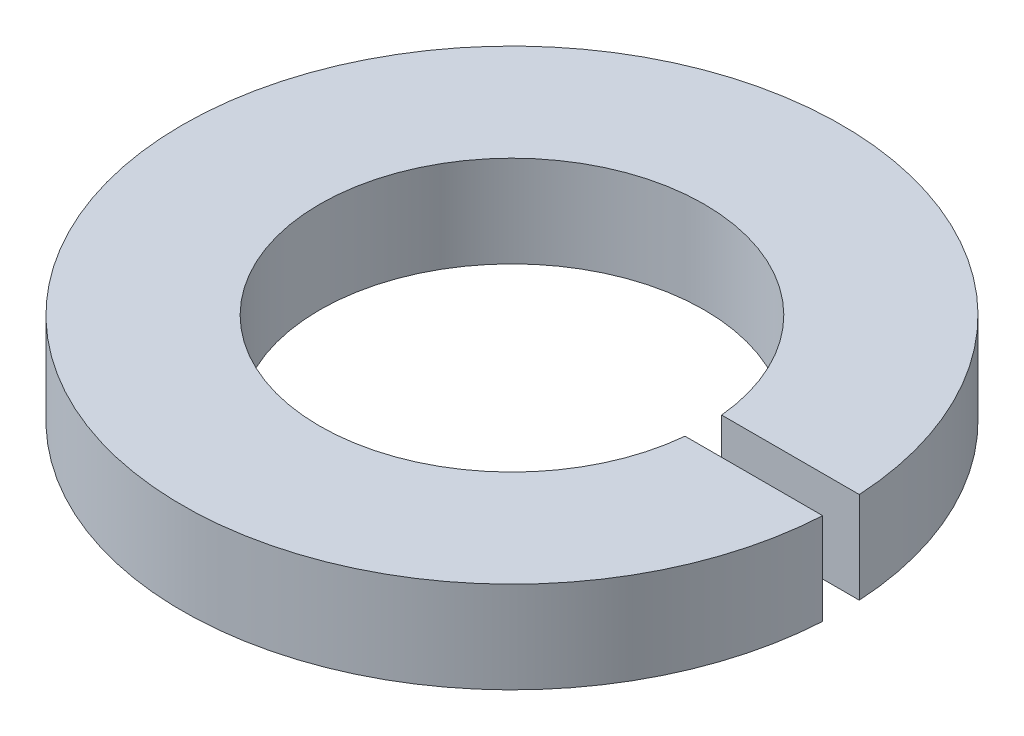
ISO-10303-21;
HEADER;
FILE_DESCRIPTION(('STEP AP214'),'2;1');
FILE_NAME('part.step','',(''),(''),'','','');
FILE_SCHEMA(('AUTOMOTIVE_DESIGN { 1 0 10303 214 1 1 1 1 }'));
ENDSEC;
DATA;
#1=APPLICATION_CONTEXT('core data for automotive mechanical design processes');
#2=APPLICATION_PROTOCOL_DEFINITION('international standard','automotive_design',2000,#1);
#3=PRODUCT_CONTEXT('',#1,'mechanical');
#4=PRODUCT('Part','Part','',(#3));
#5=PRODUCT_RELATED_PRODUCT_CATEGORY('part','',(#4));
#6=PRODUCT_DEFINITION_FORMATION('','',#4);
#7=PRODUCT_DEFINITION_CONTEXT('part definition',#1,'design');
#8=PRODUCT_DEFINITION('design','',#6,#7);
#9=PRODUCT_DEFINITION_SHAPE('','',#8);
#10=(LENGTH_UNIT() NAMED_UNIT(*) SI_UNIT(.MILLI.,.METRE.));
#11=(NAMED_UNIT(*) PLANE_ANGLE_UNIT() SI_UNIT($,.RADIAN.));
#12=(NAMED_UNIT(*) SI_UNIT($,.STERADIAN.) SOLID_ANGLE_UNIT());
#13=UNCERTAINTY_MEASURE_WITH_UNIT(LENGTH_MEASURE(1.E-05),#10,'distance_accuracy_value','');
#14=(GEOMETRIC_REPRESENTATION_CONTEXT(3) GLOBAL_UNCERTAINTY_ASSIGNED_CONTEXT((#13)) GLOBAL_UNIT_ASSIGNED_CONTEXT((#10,
#11,#12)) REPRESENTATION_CONTEXT('',''));
#15=CARTESIAN_POINT('',(0.,0.,0.));
#16=DIRECTION('',(0.,0.,1.));
#17=DIRECTION('',(1.,0.,0.));
#18=AXIS2_PLACEMENT_3D('',#15,#16,#17);
#19=CARTESIAN_POINT('',(0.,1.,0.));
#20=DIRECTION('',(0.,1.,0.));
#21=DIRECTION('',(0.,0.,1.));
#22=AXIS2_PLACEMENT_3D('',#19,#20,#21);
#23=PLANE('',#22);
#24=DIRECTION('',(1.,0.,0.));
#25=VECTOR('',#24,1.);
#26=CARTESIAN_POINT('',(2.,1.,0.2));
#27=LINE('',#26,#25);
#28=CARTESIAN_POINT('',(3.59444015112229,1.,0.2));
#29=VERTEX_POINT('',#28);
#30=CARTESIAN_POINT('',(2.09045449603669,1.,0.2));
#31=VERTEX_POINT('',#30);
#32=EDGE_CURVE('E60',#29,#31,#27,.F.);
#33=ORIENTED_EDGE('',*,*,#32,.T.);
#34=CARTESIAN_POINT('',(0.,1.,0.));
#35=DIRECTION('',(0.,-1.,0.));
#36=DIRECTION('',(0.,0.,-1.));
#37=AXIS2_PLACEMENT_3D('',#34,#35,#36);
#38=CIRCLE('',#37,2.1);
#39=CARTESIAN_POINT('',(2.09045449603669,1.,-0.2));
#40=VERTEX_POINT('',#39);
#41=EDGE_CURVE('E20',#31,#40,#38,.T.);
#42=ORIENTED_EDGE('',*,*,#41,.T.);
#43=DIRECTION('',(-1.,0.,0.));
#44=VECTOR('',#43,1.);
#45=CARTESIAN_POINT('',(2.,1.,-0.2));
#46=LINE('',#45,#44);
#47=CARTESIAN_POINT('',(3.59444015112229,1.,-0.2));
#48=VERTEX_POINT('',#47);
#49=EDGE_CURVE('E63',#40,#48,#46,.F.);
#50=ORIENTED_EDGE('',*,*,#49,.T.);
#51=CARTESIAN_POINT('',(0.,1.,0.));
#52=DIRECTION('',(0.,-1.,0.));
#53=DIRECTION('',(0.,0.,-1.));
#54=AXIS2_PLACEMENT_3D('',#51,#52,#53);
#55=CIRCLE('',#54,3.6);
#56=EDGE_CURVE('E58',#29,#48,#55,.T.);
#57=ORIENTED_EDGE('',*,*,#56,.F.);
#58=EDGE_LOOP('',(#33,#42,#50,#57));
#59=FACE_BOUND('',#58,.T.);
#60=ADVANCED_FACE('F17',(#59),#23,.T.);
#61=CARTESIAN_POINT('',(2.,0.,0.2));
#62=DIRECTION('',(0.,0.,1.));
#63=DIRECTION('',(1.,0.,0.));
#64=AXIS2_PLACEMENT_3D('',#61,#62,#63);
#65=PLANE('',#64);
#66=DIRECTION('',(0.,-1.,0.));
#67=VECTOR('',#66,1.);
#68=CARTESIAN_POINT('',(2.09045449603669,1.,0.2));
#69=LINE('',#68,#67);
#70=CARTESIAN_POINT('',(2.09045449603669,0.,0.2));
#71=VERTEX_POINT('',#70);
#72=EDGE_CURVE('E73',#71,#31,#69,.F.);
#73=ORIENTED_EDGE('',*,*,#72,.T.);
#74=ORIENTED_EDGE('',*,*,#32,.F.);
#75=DIRECTION('',(0.,1.,0.));
#76=VECTOR('',#75,1.);
#77=CARTESIAN_POINT('',(3.59444015112229,0.,0.2));
#78=LINE('',#77,#76);
#79=CARTESIAN_POINT('',(3.59444015112229,0.,0.2));
#80=VERTEX_POINT('',#79);
#81=EDGE_CURVE('E72',#80,#29,#78,.T.);
#82=ORIENTED_EDGE('',*,*,#81,.F.);
#83=DIRECTION('',(1.,0.,0.));
#84=VECTOR('',#83,1.);
#85=CARTESIAN_POINT('',(0.,0.,0.2));
#86=LINE('',#85,#84);
#87=EDGE_CURVE('E83',#80,#71,#86,.F.);
#88=ORIENTED_EDGE('',*,*,#87,.T.);
#89=EDGE_LOOP('',(#73,#74,#82,#88));
#90=FACE_BOUND('',#89,.T.);
#91=ADVANCED_FACE('F70',(#90),#65,.F.);
#92=CARTESIAN_POINT('',(0.,1.,0.));
#93=DIRECTION('',(0.,-1.,0.));
#94=DIRECTION('',(0.,0.,-1.));
#95=AXIS2_PLACEMENT_3D('',#92,#93,#94);
#96=CYLINDRICAL_SURFACE('',#95,2.1);
#97=ORIENTED_EDGE('',*,*,#41,.F.);
#98=ORIENTED_EDGE('',*,*,#72,.F.);
#99=CARTESIAN_POINT('',(0.,0.,0.));
#100=DIRECTION('',(0.,-1.,0.));
#101=DIRECTION('',(0.,0.,-1.));
#102=AXIS2_PLACEMENT_3D('',#99,#100,#101);
#103=CIRCLE('',#102,2.1);
#104=CARTESIAN_POINT('',(2.09045449603669,0.,-0.2));
#105=VERTEX_POINT('',#104);
#106=EDGE_CURVE('E26',#71,#105,#103,.T.);
#107=ORIENTED_EDGE('',*,*,#106,.T.);
#108=DIRECTION('',(0.,1.,0.));
#109=VECTOR('',#108,1.);
#110=CARTESIAN_POINT('',(2.09045449603669,0.,-0.2));
#111=LINE('',#110,#109);
#112=EDGE_CURVE('E80',#105,#40,#111,.T.);
#113=ORIENTED_EDGE('',*,*,#112,.T.);
#114=EDGE_LOOP('',(#97,#98,#107,#113));
#115=FACE_BOUND('',#114,.T.);
#116=ADVANCED_FACE('F91',(#115),#96,.F.);
#117=CARTESIAN_POINT('',(2.,0.,-0.2));
#118=DIRECTION('',(0.,0.,-1.));
#119=DIRECTION('',(-1.,0.,0.));
#120=AXIS2_PLACEMENT_3D('',#117,#118,#119);
#121=PLANE('',#120);
#122=ORIENTED_EDGE('',*,*,#112,.F.);
#123=DIRECTION('',(1.,0.,0.));
#124=VECTOR('',#123,1.);
#125=CARTESIAN_POINT('',(0.,0.,-0.2));
#126=LINE('',#125,#124);
#127=CARTESIAN_POINT('',(3.59444015112229,0.,-0.2));
#128=VERTEX_POINT('',#127);
#129=EDGE_CURVE('E10',#105,#128,#126,.T.);
#130=ORIENTED_EDGE('',*,*,#129,.T.);
#131=DIRECTION('',(0.,-1.,0.));
#132=VECTOR('',#131,1.);
#133=CARTESIAN_POINT('',(3.59444015112229,1.,-0.2));
#134=LINE('',#133,#132);
#135=EDGE_CURVE('E67',#48,#128,#134,.T.);
#136=ORIENTED_EDGE('',*,*,#135,.F.);
#137=ORIENTED_EDGE('',*,*,#49,.F.);
#138=EDGE_LOOP('',(#122,#130,#136,#137));
#139=FACE_BOUND('',#138,.T.);
#140=ADVANCED_FACE('F88',(#139),#121,.F.);
#141=CARTESIAN_POINT('',(0.,1.,0.));
#142=DIRECTION('',(0.,-1.,0.));
#143=DIRECTION('',(0.,0.,-1.));
#144=AXIS2_PLACEMENT_3D('',#141,#142,#143);
#145=CYLINDRICAL_SURFACE('',#144,3.6);
#146=ORIENTED_EDGE('',*,*,#135,.T.);
#147=CARTESIAN_POINT('',(0.,0.,0.));
#148=DIRECTION('',(0.,-1.,0.));
#149=DIRECTION('',(0.,0.,-1.));
#150=AXIS2_PLACEMENT_3D('',#147,#148,#149);
#151=CIRCLE('',#150,3.6);
#152=EDGE_CURVE('E35',#128,#80,#151,.F.);
#153=ORIENTED_EDGE('',*,*,#152,.T.);
#154=ORIENTED_EDGE('',*,*,#81,.T.);
#155=ORIENTED_EDGE('',*,*,#56,.T.);
#156=EDGE_LOOP('',(#146,#153,#154,#155));
#157=FACE_BOUND('',#156,.T.);
#158=ADVANCED_FACE('F75',(#157),#145,.T.);
#159=CARTESIAN_POINT('',(0.,0.,0.));
#160=DIRECTION('',(0.,1.,0.));
#161=DIRECTION('',(0.,0.,1.));
#162=AXIS2_PLACEMENT_3D('',#159,#160,#161);
#163=PLANE('',#162);
#164=ORIENTED_EDGE('',*,*,#129,.F.);
#165=ORIENTED_EDGE('',*,*,#106,.F.);
#166=ORIENTED_EDGE('',*,*,#87,.F.);
#167=ORIENTED_EDGE('',*,*,#152,.F.);
#168=EDGE_LOOP('',(#164,#165,#166,#167));
#169=FACE_BOUND('',#168,.T.);
#170=ADVANCED_FACE('F90',(#169),#163,.F.);
#171=CLOSED_SHELL('',(#60,#91,#116,#140,#158,#170));
#172=MANIFOLD_SOLID_BREP('B1',#171);
#173=ADVANCED_BREP_SHAPE_REPRESENTATION('',(#18,#172),#14);
#174=SHAPE_DEFINITION_REPRESENTATION(#9,#173);
ENDSEC;
END-ISO-10303-21;
